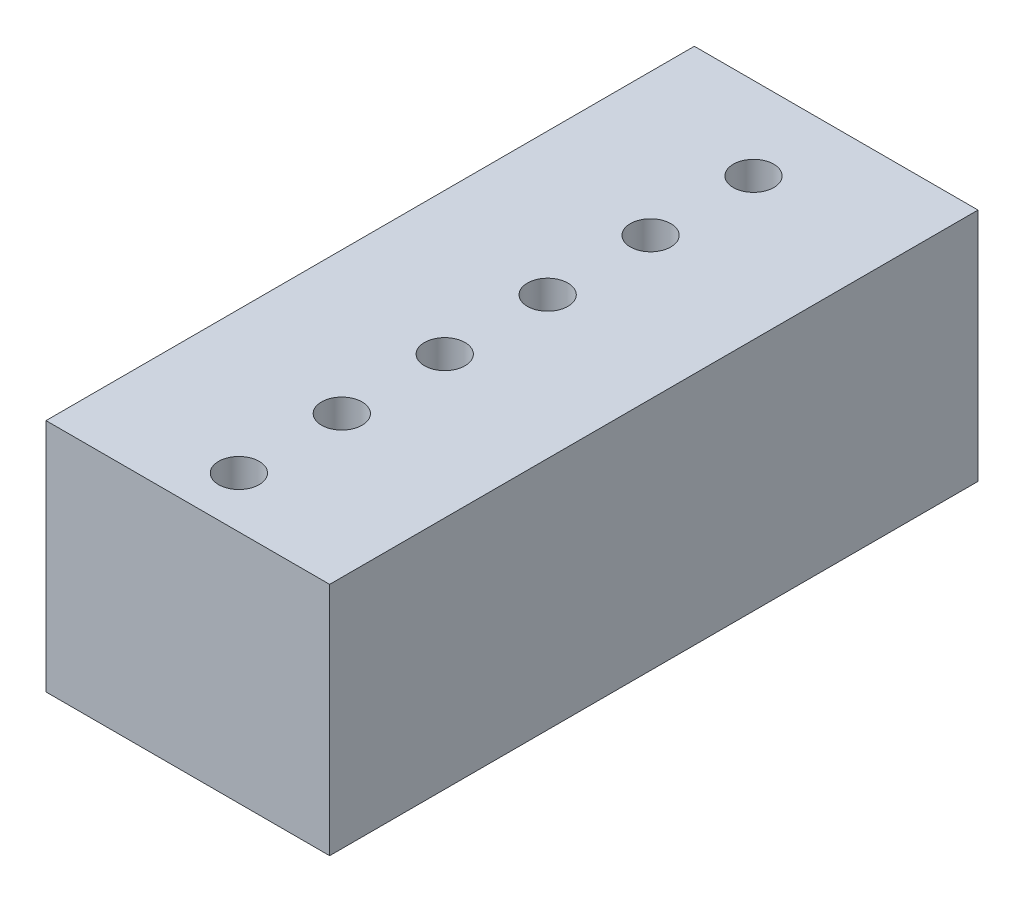
ISO-10303-21;
HEADER;
FILE_DESCRIPTION(('STEP AP214'),'2;1');
FILE_NAME('part.step','',(''),(''),'','','');
FILE_SCHEMA(('AUTOMOTIVE_DESIGN { 1 0 10303 214 1 1 1 1 }'));
ENDSEC;
DATA;
#1=APPLICATION_CONTEXT('core data for automotive mechanical design processes');
#2=APPLICATION_PROTOCOL_DEFINITION('international standard','automotive_design',2000,#1);
#3=PRODUCT_CONTEXT('',#1,'mechanical');
#4=PRODUCT('Part','Part','',(#3));
#5=PRODUCT_RELATED_PRODUCT_CATEGORY('part','',(#4));
#6=PRODUCT_DEFINITION_FORMATION('','',#4);
#7=PRODUCT_DEFINITION_CONTEXT('part definition',#1,'design');
#8=PRODUCT_DEFINITION('design','',#6,#7);
#9=PRODUCT_DEFINITION_SHAPE('','',#8);
#10=(LENGTH_UNIT() NAMED_UNIT(*) SI_UNIT(.MILLI.,.METRE.));
#11=(NAMED_UNIT(*) PLANE_ANGLE_UNIT() SI_UNIT($,.RADIAN.));
#12=(NAMED_UNIT(*) SI_UNIT($,.STERADIAN.) SOLID_ANGLE_UNIT());
#13=UNCERTAINTY_MEASURE_WITH_UNIT(LENGTH_MEASURE(1.E-05),#10,'distance_accuracy_value','');
#14=(GEOMETRIC_REPRESENTATION_CONTEXT(3) GLOBAL_UNCERTAINTY_ASSIGNED_CONTEXT((#13)) GLOBAL_UNIT_ASSIGNED_CONTEXT((#10,
#11,#12)) REPRESENTATION_CONTEXT('',''));
#15=CARTESIAN_POINT('',(0.,0.,0.));
#16=DIRECTION('',(0.,0.,1.));
#17=DIRECTION('',(1.,0.,0.));
#18=AXIS2_PLACEMENT_3D('',#15,#16,#17);
#19=CARTESIAN_POINT('',(0.,-2.9,6.74));
#20=DIRECTION('',(0.,1.,0.));
#21=DIRECTION('',(0.,0.,1.));
#22=AXIS2_PLACEMENT_3D('',#19,#20,#21);
#23=CYLINDRICAL_SURFACE('',#22,0.500000000000001);
#24=CARTESIAN_POINT('',(0.,-2.9,6.74));
#25=DIRECTION('',(0.,1.,0.));
#26=DIRECTION('',(0.,0.,1.));
#27=AXIS2_PLACEMENT_3D('',#24,#25,#26);
#28=CIRCLE('',#27,0.500000000000001);
#29=CARTESIAN_POINT('',(0.,-2.9,7.24));
#30=VERTEX_POINT('',#29);
#31=EDGE_CURVE('E41',#30,#30,#28,.T.);
#32=ORIENTED_EDGE('',*,*,#31,.F.);
#33=EDGE_LOOP('',(#32));
#34=FACE_BOUND('',#33,.T.);
#35=CARTESIAN_POINT('',(0.,2.9,6.74));
#36=DIRECTION('',(0.,1.,0.));
#37=DIRECTION('',(0.,0.,1.));
#38=AXIS2_PLACEMENT_3D('',#35,#36,#37);
#39=CIRCLE('',#38,0.500000000000001);
#40=CARTESIAN_POINT('',(0.,2.9,7.24));
#41=VERTEX_POINT('',#40);
#42=EDGE_CURVE('E11',#41,#41,#39,.T.);
#43=ORIENTED_EDGE('',*,*,#42,.T.);
#44=EDGE_LOOP('',(#43));
#45=FACE_BOUND('',#44,.T.);
#46=ADVANCED_FACE('F33',(#34,#45),#23,.F.);
#47=CARTESIAN_POINT('',(0.,-2.9,4.2));
#48=DIRECTION('',(0.,1.,0.));
#49=DIRECTION('',(0.,0.,1.));
#50=AXIS2_PLACEMENT_3D('',#47,#48,#49);
#51=CYLINDRICAL_SURFACE('',#50,0.500000000000001);
#52=CARTESIAN_POINT('',(0.,-2.9,4.2));
#53=DIRECTION('',(0.,1.,0.));
#54=DIRECTION('',(0.,0.,1.));
#55=AXIS2_PLACEMENT_3D('',#52,#53,#54);
#56=CIRCLE('',#55,0.500000000000001);
#57=CARTESIAN_POINT('',(0.,-2.9,4.7));
#58=VERTEX_POINT('',#57);
#59=EDGE_CURVE('E126',#58,#58,#56,.T.);
#60=ORIENTED_EDGE('',*,*,#59,.F.);
#61=EDGE_LOOP('',(#60));
#62=FACE_BOUND('',#61,.T.);
#63=CARTESIAN_POINT('',(0.,2.9,4.2));
#64=DIRECTION('',(0.,1.,0.));
#65=DIRECTION('',(0.,0.,1.));
#66=AXIS2_PLACEMENT_3D('',#63,#64,#65);
#67=CIRCLE('',#66,0.500000000000001);
#68=CARTESIAN_POINT('',(0.,2.9,4.7));
#69=VERTEX_POINT('',#68);
#70=EDGE_CURVE('E129',#69,#69,#67,.T.);
#71=ORIENTED_EDGE('',*,*,#70,.T.);
#72=EDGE_LOOP('',(#71));
#73=FACE_BOUND('',#72,.T.);
#74=ADVANCED_FACE('F138',(#62,#73),#51,.F.);
#75=CARTESIAN_POINT('',(0.,-2.9,1.66));
#76=DIRECTION('',(0.,1.,0.));
#77=DIRECTION('',(0.,0.,1.));
#78=AXIS2_PLACEMENT_3D('',#75,#76,#77);
#79=CYLINDRICAL_SURFACE('',#78,0.500000000000001);
#80=CARTESIAN_POINT('',(0.,-2.9,1.66));
#81=DIRECTION('',(0.,1.,0.));
#82=DIRECTION('',(0.,0.,1.));
#83=AXIS2_PLACEMENT_3D('',#80,#81,#82);
#84=CIRCLE('',#83,0.500000000000001);
#85=CARTESIAN_POINT('',(0.,-2.9,2.16));
#86=VERTEX_POINT('',#85);
#87=EDGE_CURVE('E120',#86,#86,#84,.T.);
#88=ORIENTED_EDGE('',*,*,#87,.F.);
#89=EDGE_LOOP('',(#88));
#90=FACE_BOUND('',#89,.T.);
#91=CARTESIAN_POINT('',(0.,2.9,1.66));
#92=DIRECTION('',(0.,1.,0.));
#93=DIRECTION('',(0.,0.,1.));
#94=AXIS2_PLACEMENT_3D('',#91,#92,#93);
#95=CIRCLE('',#94,0.500000000000001);
#96=CARTESIAN_POINT('',(0.,2.9,2.16));
#97=VERTEX_POINT('',#96);
#98=EDGE_CURVE('E123',#97,#97,#95,.T.);
#99=ORIENTED_EDGE('',*,*,#98,.T.);
#100=EDGE_LOOP('',(#99));
#101=FACE_BOUND('',#100,.T.);
#102=ADVANCED_FACE('F168',(#90,#101),#79,.F.);
#103=CARTESIAN_POINT('',(0.,-2.9,-0.880000000000003));
#104=DIRECTION('',(0.,1.,0.));
#105=DIRECTION('',(0.,0.,1.));
#106=AXIS2_PLACEMENT_3D('',#103,#104,#105);
#107=CYLINDRICAL_SURFACE('',#106,0.500000000000001);
#108=CARTESIAN_POINT('',(0.,-2.9,-0.880000000000003));
#109=DIRECTION('',(0.,1.,0.));
#110=DIRECTION('',(0.,0.,1.));
#111=AXIS2_PLACEMENT_3D('',#108,#109,#110);
#112=CIRCLE('',#111,0.500000000000001);
#113=CARTESIAN_POINT('',(0.,-2.9,-0.380000000000003));
#114=VERTEX_POINT('',#113);
#115=EDGE_CURVE('E112',#114,#114,#112,.T.);
#116=ORIENTED_EDGE('',*,*,#115,.F.);
#117=EDGE_LOOP('',(#116));
#118=FACE_BOUND('',#117,.T.);
#119=CARTESIAN_POINT('',(0.,2.9,-0.880000000000003));
#120=DIRECTION('',(0.,1.,0.));
#121=DIRECTION('',(0.,0.,1.));
#122=AXIS2_PLACEMENT_3D('',#119,#120,#121);
#123=CIRCLE('',#122,0.500000000000001);
#124=CARTESIAN_POINT('',(0.,2.9,-0.380000000000003));
#125=VERTEX_POINT('',#124);
#126=EDGE_CURVE('E117',#125,#125,#123,.T.);
#127=ORIENTED_EDGE('',*,*,#126,.T.);
#128=EDGE_LOOP('',(#127));
#129=FACE_BOUND('',#128,.T.);
#130=ADVANCED_FACE('F165',(#118,#129),#107,.F.);
#131=CARTESIAN_POINT('',(3.5,2.9,8.));
#132=DIRECTION('',(0.,0.,1.));
#133=DIRECTION('',(1.,0.,0.));
#134=AXIS2_PLACEMENT_3D('',#131,#132,#133);
#135=PLANE('',#134);
#136=DIRECTION('',(-1.,0.,0.));
#137=VECTOR('',#136,1.);
#138=CARTESIAN_POINT('',(3.5,-2.9,8.));
#139=LINE('',#138,#137);
#140=CARTESIAN_POINT('',(3.5,-2.9,8.));
#141=VERTEX_POINT('',#140);
#142=CARTESIAN_POINT('',(-3.5,-2.9,8.));
#143=VERTEX_POINT('',#142);
#144=EDGE_CURVE('E102',#141,#143,#139,.T.);
#145=ORIENTED_EDGE('',*,*,#144,.F.);
#146=DIRECTION('',(0.,-1.,0.));
#147=VECTOR('',#146,1.);
#148=CARTESIAN_POINT('',(3.5,2.9,8.));
#149=LINE('',#148,#147);
#150=CARTESIAN_POINT('',(3.5,2.9,8.));
#151=VERTEX_POINT('',#150);
#152=EDGE_CURVE('E49',#151,#141,#149,.T.);
#153=ORIENTED_EDGE('',*,*,#152,.F.);
#154=DIRECTION('',(-1.,0.,0.));
#155=VECTOR('',#154,1.);
#156=CARTESIAN_POINT('',(3.5,2.9,8.));
#157=LINE('',#156,#155);
#158=CARTESIAN_POINT('',(-3.5,2.9,8.));
#159=VERTEX_POINT('',#158);
#160=EDGE_CURVE('E95',#151,#159,#157,.T.);
#161=ORIENTED_EDGE('',*,*,#160,.T.);
#162=DIRECTION('',(0.,-1.,0.));
#163=VECTOR('',#162,1.);
#164=CARTESIAN_POINT('',(-3.5,2.9,8.));
#165=LINE('',#164,#163);
#166=EDGE_CURVE('E92',#159,#143,#165,.T.);
#167=ORIENTED_EDGE('',*,*,#166,.T.);
#168=EDGE_LOOP('',(#145,#153,#161,#167));
#169=FACE_BOUND('',#168,.T.);
#170=ADVANCED_FACE('F160',(#169),#135,.T.);
#171=CARTESIAN_POINT('',(3.5,2.9,-8.));
#172=DIRECTION('',(1.,0.,0.));
#173=DIRECTION('',(0.,0.,-1.));
#174=AXIS2_PLACEMENT_3D('',#171,#172,#173);
#175=PLANE('',#174);
#176=DIRECTION('',(0.,0.,1.));
#177=VECTOR('',#176,1.);
#178=CARTESIAN_POINT('',(3.5,-2.9,-8.));
#179=LINE('',#178,#177);
#180=CARTESIAN_POINT('',(3.5,-2.9,-8.));
#181=VERTEX_POINT('',#180);
#182=EDGE_CURVE('E97',#181,#141,#179,.T.);
#183=ORIENTED_EDGE('',*,*,#182,.F.);
#184=DIRECTION('',(0.,-1.,0.));
#185=VECTOR('',#184,1.);
#186=CARTESIAN_POINT('',(3.5,2.9,-8.));
#187=LINE('',#186,#185);
#188=CARTESIAN_POINT('',(3.5,2.9,-8.));
#189=VERTEX_POINT('',#188);
#190=EDGE_CURVE('E65',#189,#181,#187,.T.);
#191=ORIENTED_EDGE('',*,*,#190,.F.);
#192=DIRECTION('',(0.,0.,1.));
#193=VECTOR('',#192,1.);
#194=CARTESIAN_POINT('',(3.5,2.9,-8.));
#195=LINE('',#194,#193);
#196=EDGE_CURVE('E83',#189,#151,#195,.T.);
#197=ORIENTED_EDGE('',*,*,#196,.T.);
#198=ORIENTED_EDGE('',*,*,#152,.T.);
#199=EDGE_LOOP('',(#183,#191,#197,#198));
#200=FACE_BOUND('',#199,.T.);
#201=ADVANCED_FACE('F157',(#200),#175,.T.);
#202=CARTESIAN_POINT('',(3.5,2.9,-8.));
#203=DIRECTION('',(0.,0.,1.));
#204=DIRECTION('',(1.,0.,0.));
#205=AXIS2_PLACEMENT_3D('',#202,#203,#204);
#206=PLANE('',#205);
#207=DIRECTION('',(-1.,0.,0.));
#208=VECTOR('',#207,1.);
#209=CARTESIAN_POINT('',(3.5,-2.9,-8.));
#210=LINE('',#209,#208);
#211=CARTESIAN_POINT('',(-3.5,-2.9,-8.));
#212=VERTEX_POINT('',#211);
#213=EDGE_CURVE('E88',#181,#212,#210,.T.);
#214=ORIENTED_EDGE('',*,*,#213,.T.);
#215=DIRECTION('',(0.,-1.,0.));
#216=VECTOR('',#215,1.);
#217=CARTESIAN_POINT('',(-3.5,2.9,-8.));
#218=LINE('',#217,#216);
#219=CARTESIAN_POINT('',(-3.5,2.9,-8.));
#220=VERTEX_POINT('',#219);
#221=EDGE_CURVE('E86',#220,#212,#218,.T.);
#222=ORIENTED_EDGE('',*,*,#221,.F.);
#223=DIRECTION('',(-1.,0.,0.));
#224=VECTOR('',#223,1.);
#225=CARTESIAN_POINT('',(3.5,2.9,-8.));
#226=LINE('',#225,#224);
#227=EDGE_CURVE('E79',#189,#220,#226,.T.);
#228=ORIENTED_EDGE('',*,*,#227,.F.);
#229=ORIENTED_EDGE('',*,*,#190,.T.);
#230=EDGE_LOOP('',(#214,#222,#228,#229));
#231=FACE_BOUND('',#230,.T.);
#232=ADVANCED_FACE('F87',(#231),#206,.F.);
#233=CARTESIAN_POINT('',(-3.5,2.9,-8.));
#234=DIRECTION('',(1.,0.,0.));
#235=DIRECTION('',(0.,0.,-1.));
#236=AXIS2_PLACEMENT_3D('',#233,#234,#235);
#237=PLANE('',#236);
#238=DIRECTION('',(0.,0.,1.));
#239=VECTOR('',#238,1.);
#240=CARTESIAN_POINT('',(-3.5,-2.9,-8.));
#241=LINE('',#240,#239);
#242=EDGE_CURVE('E105',#212,#143,#241,.T.);
#243=ORIENTED_EDGE('',*,*,#242,.T.);
#244=ORIENTED_EDGE('',*,*,#166,.F.);
#245=DIRECTION('',(0.,0.,1.));
#246=VECTOR('',#245,1.);
#247=CARTESIAN_POINT('',(-3.5,2.9,-8.));
#248=LINE('',#247,#246);
#249=EDGE_CURVE('E76',#220,#159,#248,.T.);
#250=ORIENTED_EDGE('',*,*,#249,.F.);
#251=ORIENTED_EDGE('',*,*,#221,.T.);
#252=EDGE_LOOP('',(#243,#244,#250,#251));
#253=FACE_BOUND('',#252,.T.);
#254=ADVANCED_FACE('F94',(#253),#237,.F.);
#255=CARTESIAN_POINT('',(0.,2.9,0.));
#256=DIRECTION('',(0.,1.,0.));
#257=DIRECTION('',(0.,0.,1.));
#258=AXIS2_PLACEMENT_3D('',#255,#256,#257);
#259=PLANE('',#258);
#260=CARTESIAN_POINT('',(0.,2.9,-3.42));
#261=DIRECTION('',(0.,1.,0.));
#262=DIRECTION('',(0.,0.,1.));
#263=AXIS2_PLACEMENT_3D('',#260,#261,#262);
#264=CIRCLE('',#263,0.500000000000001);
#265=CARTESIAN_POINT('',(0.,2.9,-2.92));
#266=VERTEX_POINT('',#265);
#267=EDGE_CURVE('E253',#266,#266,#264,.T.);
#268=ORIENTED_EDGE('',*,*,#267,.F.);
#269=EDGE_LOOP('',(#268));
#270=FACE_BOUND('',#269,.T.);
#271=CARTESIAN_POINT('',(0.,2.9,-5.96));
#272=DIRECTION('',(0.,1.,0.));
#273=DIRECTION('',(0.,0.,1.));
#274=AXIS2_PLACEMENT_3D('',#271,#272,#273);
#275=CIRCLE('',#274,0.500000000000001);
#276=CARTESIAN_POINT('',(0.,2.9,-5.46));
#277=VERTEX_POINT('',#276);
#278=EDGE_CURVE('E254',#277,#277,#275,.T.);
#279=ORIENTED_EDGE('',*,*,#278,.F.);
#280=EDGE_LOOP('',(#279));
#281=FACE_BOUND('',#280,.T.);
#282=ORIENTED_EDGE('',*,*,#160,.F.);
#283=ORIENTED_EDGE('',*,*,#196,.F.);
#284=ORIENTED_EDGE('',*,*,#227,.T.);
#285=ORIENTED_EDGE('',*,*,#249,.T.);
#286=EDGE_LOOP('',(#282,#283,#284,#285));
#287=FACE_BOUND('',#286,.T.);
#288=ORIENTED_EDGE('',*,*,#126,.F.);
#289=EDGE_LOOP('',(#288));
#290=FACE_BOUND('',#289,.T.);
#291=ORIENTED_EDGE('',*,*,#98,.F.);
#292=EDGE_LOOP('',(#291));
#293=FACE_BOUND('',#292,.T.);
#294=ORIENTED_EDGE('',*,*,#70,.F.);
#295=EDGE_LOOP('',(#294));
#296=FACE_BOUND('',#295,.T.);
#297=ORIENTED_EDGE('',*,*,#42,.F.);
#298=EDGE_LOOP('',(#297));
#299=FACE_BOUND('',#298,.T.);
#300=ADVANCED_FACE('F81',(#270,#281,#287,#290,#293,#296,#299),#259,.T.);
#301=CARTESIAN_POINT('',(0.,-2.9,0.));
#302=DIRECTION('',(0.,1.,0.));
#303=DIRECTION('',(0.,0.,1.));
#304=AXIS2_PLACEMENT_3D('',#301,#302,#303);
#305=PLANE('',#304);
#306=CARTESIAN_POINT('',(0.,-2.9,-3.42));
#307=DIRECTION('',(0.,1.,0.));
#308=DIRECTION('',(0.,0.,1.));
#309=AXIS2_PLACEMENT_3D('',#306,#307,#308);
#310=CIRCLE('',#309,0.500000000000001);
#311=CARTESIAN_POINT('',(0.,-2.9,-2.92));
#312=VERTEX_POINT('',#311);
#313=EDGE_CURVE('E251',#312,#312,#310,.T.);
#314=ORIENTED_EDGE('',*,*,#313,.T.);
#315=EDGE_LOOP('',(#314));
#316=FACE_BOUND('',#315,.T.);
#317=CARTESIAN_POINT('',(0.,-2.9,-5.96));
#318=DIRECTION('',(0.,1.,0.));
#319=DIRECTION('',(0.,0.,1.));
#320=AXIS2_PLACEMENT_3D('',#317,#318,#319);
#321=CIRCLE('',#320,0.500000000000001);
#322=CARTESIAN_POINT('',(0.,-2.9,-5.46));
#323=VERTEX_POINT('',#322);
#324=EDGE_CURVE('E106',#323,#323,#321,.T.);
#325=ORIENTED_EDGE('',*,*,#324,.T.);
#326=EDGE_LOOP('',(#325));
#327=FACE_BOUND('',#326,.T.);
#328=ORIENTED_EDGE('',*,*,#144,.T.);
#329=ORIENTED_EDGE('',*,*,#242,.F.);
#330=ORIENTED_EDGE('',*,*,#213,.F.);
#331=ORIENTED_EDGE('',*,*,#182,.T.);
#332=EDGE_LOOP('',(#328,#329,#330,#331));
#333=FACE_BOUND('',#332,.T.);
#334=ORIENTED_EDGE('',*,*,#115,.T.);
#335=EDGE_LOOP('',(#334));
#336=FACE_BOUND('',#335,.T.);
#337=ORIENTED_EDGE('',*,*,#87,.T.);
#338=EDGE_LOOP('',(#337));
#339=FACE_BOUND('',#338,.T.);
#340=ORIENTED_EDGE('',*,*,#59,.T.);
#341=EDGE_LOOP('',(#340));
#342=FACE_BOUND('',#341,.T.);
#343=ORIENTED_EDGE('',*,*,#31,.T.);
#344=EDGE_LOOP('',(#343));
#345=FACE_BOUND('',#344,.T.);
#346=ADVANCED_FACE('F134',(#316,#327,#333,#336,#339,#342,#345),#305,.F.);
#347=CARTESIAN_POINT('',(0.,-2.9,-5.96));
#348=DIRECTION('',(0.,1.,0.));
#349=DIRECTION('',(0.,0.,1.));
#350=AXIS2_PLACEMENT_3D('',#347,#348,#349);
#351=CYLINDRICAL_SURFACE('',#350,0.500000000000001);
#352=ORIENTED_EDGE('',*,*,#324,.F.);
#353=EDGE_LOOP('',(#352));
#354=FACE_BOUND('',#353,.T.);
#355=ORIENTED_EDGE('',*,*,#278,.T.);
#356=EDGE_LOOP('',(#355));
#357=FACE_BOUND('',#356,.T.);
#358=ADVANCED_FACE('F148',(#354,#357),#351,.F.);
#359=CARTESIAN_POINT('',(0.,-2.9,-3.42));
#360=DIRECTION('',(0.,1.,0.));
#361=DIRECTION('',(0.,0.,1.));
#362=AXIS2_PLACEMENT_3D('',#359,#360,#361);
#363=CYLINDRICAL_SURFACE('',#362,0.500000000000001);
#364=ORIENTED_EDGE('',*,*,#313,.F.);
#365=EDGE_LOOP('',(#364));
#366=FACE_BOUND('',#365,.T.);
#367=ORIENTED_EDGE('',*,*,#267,.T.);
#368=EDGE_LOOP('',(#367));
#369=FACE_BOUND('',#368,.T.);
#370=ADVANCED_FACE('F216',(#366,#369),#363,.F.);
#371=CLOSED_SHELL('',(#46,#74,#102,#130,#170,#201,#232,#254,#300,#346,#358,#370));
#372=MANIFOLD_SOLID_BREP('B2',#371);
#373=ADVANCED_BREP_SHAPE_REPRESENTATION('',(#18,#372),#14);
#374=SHAPE_DEFINITION_REPRESENTATION(#9,#373);
ENDSEC;
END-ISO-10303-21;
